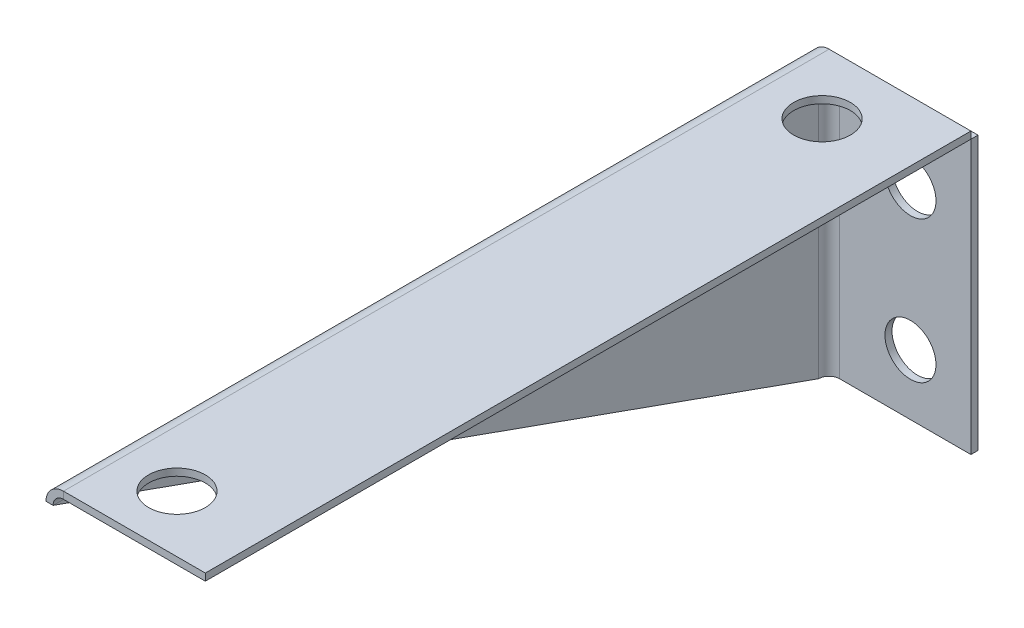
ISO-10303-21;
HEADER;
FILE_DESCRIPTION(('STEP AP214'),'2;1');
FILE_NAME('part.step','',(''),(''),'','','');
FILE_SCHEMA(('AUTOMOTIVE_DESIGN { 1 0 10303 214 1 1 1 1 }'));
ENDSEC;
DATA;
#1=APPLICATION_CONTEXT('core data for automotive mechanical design processes');
#2=APPLICATION_PROTOCOL_DEFINITION('international standard','automotive_design',2000,#1);
#3=PRODUCT_CONTEXT('',#1,'mechanical');
#4=PRODUCT('Part','Part','',(#3));
#5=PRODUCT_RELATED_PRODUCT_CATEGORY('part','',(#4));
#6=PRODUCT_DEFINITION_FORMATION('','',#4);
#7=PRODUCT_DEFINITION_CONTEXT('part definition',#1,'design');
#8=PRODUCT_DEFINITION('design','',#6,#7);
#9=PRODUCT_DEFINITION_SHAPE('','',#8);
#10=(LENGTH_UNIT() NAMED_UNIT(*) SI_UNIT(.MILLI.,.METRE.));
#11=(NAMED_UNIT(*) PLANE_ANGLE_UNIT() SI_UNIT($,.RADIAN.));
#12=(NAMED_UNIT(*) SI_UNIT($,.STERADIAN.) SOLID_ANGLE_UNIT());
#13=UNCERTAINTY_MEASURE_WITH_UNIT(LENGTH_MEASURE(1.E-05),#10,'distance_accuracy_value','');
#14=(GEOMETRIC_REPRESENTATION_CONTEXT(3) GLOBAL_UNCERTAINTY_ASSIGNED_CONTEXT((#13)) GLOBAL_UNIT_ASSIGNED_CONTEXT((#10,
#11,#12)) REPRESENTATION_CONTEXT('',''));
#15=CARTESIAN_POINT('',(0.,0.,0.));
#16=DIRECTION('',(0.,0.,1.));
#17=DIRECTION('',(1.,0.,0.));
#18=AXIS2_PLACEMENT_3D('',#15,#16,#17);
#19=CARTESIAN_POINT('',(-37.6927723239376,1.28228497629736E-13,0.));
#20=DIRECTION('',(-1.,0.,0.));
#21=DIRECTION('',(0.,-1.,0.));
#22=AXIS2_PLACEMENT_3D('',#19,#20,#21);
#23=PLANE('',#22);
#24=DIRECTION('',(0.,1.,0.));
#25=VECTOR('',#24,1.);
#26=CARTESIAN_POINT('',(-37.6927723239376,-0.499999999999998,-20.4635156034365));
#27=LINE('',#26,#25);
#28=CARTESIAN_POINT('',(-37.6927723239377,-20.5,-20.4635156034365));
#29=VERTEX_POINT('',#28);
#30=CARTESIAN_POINT('',(-37.6927723239377,-1.2366,-20.4635156034365));
#31=VERTEX_POINT('',#30);
#32=EDGE_CURVE('E212',#29,#31,#27,.T.);
#33=ORIENTED_EDGE('',*,*,#32,.F.);
#34=DIRECTION('',(0.,-0.335991197489804,-0.941865125805902));
#35=VECTOR('',#34,1.);
#36=CARTESIAN_POINT('',(-37.6927723239377,-11.7099020296282,4.17726901402858));
#37=LINE('',#36,#35);
#38=CARTESIAN_POINT('',(-37.6927723239376,-1.2366,33.5364843965635));
#39=VERTEX_POINT('',#38);
#40=EDGE_CURVE('E202',#39,#29,#37,.T.);
#41=ORIENTED_EDGE('',*,*,#40,.F.);
#42=DIRECTION('',(0.,0.,-1.));
#43=VECTOR('',#42,1.);
#44=CARTESIAN_POINT('',(-37.6927723239376,-1.2366,0.));
#45=LINE('',#44,#43);
#46=EDGE_CURVE('E218',#39,#31,#45,.T.);
#47=ORIENTED_EDGE('',*,*,#46,.T.);
#48=EDGE_LOOP('',(#33,#41,#47));
#49=FACE_BOUND('',#48,.T.);
#50=ADVANCED_FACE('F76',(#49),#23,.T.);
#51=CARTESIAN_POINT('',(-37.1927723239376,1.26482755949181E-13,0.));
#52=DIRECTION('',(-1.,0.,0.));
#53=DIRECTION('',(0.,-1.,0.));
#54=AXIS2_PLACEMENT_3D('',#51,#52,#53);
#55=PLANE('',#54);
#56=DIRECTION('',(0.,-0.335991197489804,-0.941865125805902));
#57=VECTOR('',#56,1.);
#58=CARTESIAN_POINT('',(-37.1927723239377,-11.7099020296282,4.17726901402858));
#59=LINE('',#58,#57);
#60=CARTESIAN_POINT('',(-37.1927723239376,-1.2366,33.5364843965635));
#61=VERTEX_POINT('',#60);
#62=CARTESIAN_POINT('',(-37.1927723239377,-20.5,-20.4635156034365));
#63=VERTEX_POINT('',#62);
#64=EDGE_CURVE('E193',#61,#63,#59,.T.);
#65=ORIENTED_EDGE('',*,*,#64,.T.);
#66=DIRECTION('',(0.,-1.,0.));
#67=VECTOR('',#66,1.);
#68=CARTESIAN_POINT('',(-37.1927723239376,1.30032610041011E-13,-20.4635156034365));
#69=LINE('',#68,#67);
#70=CARTESIAN_POINT('',(-37.1927723239376,-1.2366,-20.4635156034365));
#71=VERTEX_POINT('',#70);
#72=EDGE_CURVE('E215',#63,#71,#69,.F.);
#73=ORIENTED_EDGE('',*,*,#72,.T.);
#74=DIRECTION('',(0.,0.,1.));
#75=VECTOR('',#74,1.);
#76=CARTESIAN_POINT('',(-37.1927723239376,-1.2366,33.5364843965635));
#77=LINE('',#76,#75);
#78=EDGE_CURVE('E224',#61,#71,#77,.F.);
#79=ORIENTED_EDGE('',*,*,#78,.F.);
#80=EDGE_LOOP('',(#65,#73,#79));
#81=FACE_BOUND('',#80,.T.);
#82=ADVANCED_FACE('F323',(#81),#55,.F.);
#83=CARTESIAN_POINT('',(-36.4561723239376,-0.5,-20.4635156034365));
#84=DIRECTION('',(0.,0.,-1.));
#85=DIRECTION('',(-1.,0.,0.));
#86=AXIS2_PLACEMENT_3D('',#83,#84,#85);
#87=PLANE('',#86);
#88=DIRECTION('',(-1.,0.,0.));
#89=VECTOR('',#88,1.);
#90=CARTESIAN_POINT('',(-36.4561723239376,0.,-20.4635156034365));
#91=LINE('',#90,#89);
#92=CARTESIAN_POINT('',(-26.4561723239376,0.,-20.4635156034365));
#93=VERTEX_POINT('',#92);
#94=CARTESIAN_POINT('',(-36.4561723239376,0.,-20.4635156034365));
#95=VERTEX_POINT('',#94);
#96=EDGE_CURVE('E123',#93,#95,#91,.T.);
#97=ORIENTED_EDGE('',*,*,#96,.F.);
#98=DIRECTION('',(0.,1.,0.));
#99=VECTOR('',#98,1.);
#100=CARTESIAN_POINT('',(-26.4561723239376,-0.5,-20.4635156034365));
#101=LINE('',#100,#99);
#102=CARTESIAN_POINT('',(-26.4561723239376,-0.5,-20.4635156034365));
#103=VERTEX_POINT('',#102);
#104=EDGE_CURVE('E86',#103,#93,#101,.T.);
#105=ORIENTED_EDGE('',*,*,#104,.F.);
#106=DIRECTION('',(-1.,0.,0.));
#107=VECTOR('',#106,1.);
#108=CARTESIAN_POINT('',(-36.4561723239376,-0.5,-20.4635156034365));
#109=LINE('',#108,#107);
#110=CARTESIAN_POINT('',(-36.4561723239376,-0.500000000000003,-20.4635156034365));
#111=VERTEX_POINT('',#110);
#112=EDGE_CURVE('E138',#103,#111,#109,.T.);
#113=ORIENTED_EDGE('',*,*,#112,.T.);
#114=DIRECTION('',(0.,1.,0.));
#115=VECTOR('',#114,1.);
#116=CARTESIAN_POINT('',(-36.4561723239376,-0.5,-20.4635156034365));
#117=LINE('',#116,#115);
#118=EDGE_CURVE('E13',#111,#95,#117,.T.);
#119=ORIENTED_EDGE('',*,*,#118,.T.);
#120=EDGE_LOOP('',(#97,#105,#113,#119));
#121=FACE_BOUND('',#120,.T.);
#122=ADVANCED_FACE('F126',(#121),#87,.T.);
#123=CARTESIAN_POINT('',(-26.4561723239376,-0.5,-20.4635156034365));
#124=DIRECTION('',(1.,0.,0.));
#125=DIRECTION('',(0.,0.,-1.));
#126=AXIS2_PLACEMENT_3D('',#123,#124,#125);
#127=PLANE('',#126);
#128=DIRECTION('',(0.,0.,-1.));
#129=VECTOR('',#128,1.);
#130=CARTESIAN_POINT('',(-26.4561723239376,0.,-20.4635156034365));
#131=LINE('',#130,#129);
#132=CARTESIAN_POINT('',(-26.4561723239376,0.,33.5364843965635));
#133=VERTEX_POINT('',#132);
#134=EDGE_CURVE('E113',#133,#93,#131,.T.);
#135=ORIENTED_EDGE('',*,*,#134,.F.);
#136=DIRECTION('',(0.,1.,0.));
#137=VECTOR('',#136,1.);
#138=CARTESIAN_POINT('',(-26.4561723239376,-0.5,33.5364843965635));
#139=LINE('',#138,#137);
#140=CARTESIAN_POINT('',(-26.4561723239376,-0.5,33.5364843965635));
#141=VERTEX_POINT('',#140);
#142=EDGE_CURVE('E108',#141,#133,#139,.T.);
#143=ORIENTED_EDGE('',*,*,#142,.F.);
#144=DIRECTION('',(0.,0.,-1.));
#145=VECTOR('',#144,1.);
#146=CARTESIAN_POINT('',(-26.4561723239376,-0.5,-20.4635156034365));
#147=LINE('',#146,#145);
#148=EDGE_CURVE('E116',#141,#103,#147,.T.);
#149=ORIENTED_EDGE('',*,*,#148,.T.);
#150=ORIENTED_EDGE('',*,*,#104,.T.);
#151=EDGE_LOOP('',(#135,#143,#149,#150));
#152=FACE_BOUND('',#151,.T.);
#153=ADVANCED_FACE('F112',(#152),#127,.T.);
#154=CARTESIAN_POINT('',(-36.4561723239376,-0.5,33.5364843965635));
#155=DIRECTION('',(0.,0.,1.));
#156=DIRECTION('',(1.,0.,0.));
#157=AXIS2_PLACEMENT_3D('',#154,#155,#156);
#158=PLANE('',#157);
#159=DIRECTION('',(1.,0.,0.));
#160=VECTOR('',#159,1.);
#161=CARTESIAN_POINT('',(-36.4561723239376,0.,33.5364843965635));
#162=LINE('',#161,#160);
#163=CARTESIAN_POINT('',(-36.4561723239376,0.,33.5364843965635));
#164=VERTEX_POINT('',#163);
#165=EDGE_CURVE('E124',#164,#133,#162,.T.);
#166=ORIENTED_EDGE('',*,*,#165,.F.);
#167=DIRECTION('',(0.,1.,0.));
#168=VECTOR('',#167,1.);
#169=CARTESIAN_POINT('',(-36.4561723239376,-0.5,33.5364843965635));
#170=LINE('',#169,#168);
#171=CARTESIAN_POINT('',(-36.4561723239376,-0.500000000000003,33.5364843965635));
#172=VERTEX_POINT('',#171);
#173=EDGE_CURVE('E136',#172,#164,#170,.T.);
#174=ORIENTED_EDGE('',*,*,#173,.F.);
#175=DIRECTION('',(1.,0.,0.));
#176=VECTOR('',#175,1.);
#177=CARTESIAN_POINT('',(-36.4561723239376,-0.5,33.5364843965635));
#178=LINE('',#177,#176);
#179=EDGE_CURVE('E131',#172,#141,#178,.T.);
#180=ORIENTED_EDGE('',*,*,#179,.T.);
#181=ORIENTED_EDGE('',*,*,#142,.T.);
#182=EDGE_LOOP('',(#166,#174,#180,#181));
#183=FACE_BOUND('',#182,.T.);
#184=ADVANCED_FACE('F78',(#183),#158,.T.);
#185=CARTESIAN_POINT('',(0.,-0.5,0.));
#186=DIRECTION('',(0.,1.,0.));
#187=DIRECTION('',(0.,0.,1.));
#188=AXIS2_PLACEMENT_3D('',#185,#186,#187);
#189=PLANE('',#188);
#190=CARTESIAN_POINT('',(-32.4561723239376,-0.5,-15.9635156034365));
#191=DIRECTION('',(0.,1.,0.));
#192=DIRECTION('',(0.,0.,1.));
#193=AXIS2_PLACEMENT_3D('',#190,#191,#192);
#194=CIRCLE('',#193,2.);
#195=CARTESIAN_POINT('',(-32.4561723239376,-0.5,-13.9635156034365));
#196=VERTEX_POINT('',#195);
#197=EDGE_CURVE('E606',#196,#196,#194,.T.);
#198=ORIENTED_EDGE('',*,*,#197,.T.);
#199=EDGE_LOOP('',(#198));
#200=FACE_BOUND('',#199,.T.);
#201=CARTESIAN_POINT('',(-32.4561723239376,-0.5,29.5364843965635));
#202=DIRECTION('',(0.,1.,0.));
#203=DIRECTION('',(0.,0.,1.));
#204=AXIS2_PLACEMENT_3D('',#201,#202,#203);
#205=CIRCLE('',#204,2.);
#206=CARTESIAN_POINT('',(-32.4561723239376,-0.5,31.5364843965635));
#207=VERTEX_POINT('',#206);
#208=EDGE_CURVE('E610',#207,#207,#205,.T.);
#209=ORIENTED_EDGE('',*,*,#208,.T.);
#210=EDGE_LOOP('',(#209));
#211=FACE_BOUND('',#210,.T.);
#212=DIRECTION('',(0.,0.,1.));
#213=VECTOR('',#212,1.);
#214=CARTESIAN_POINT('',(-36.4561723239376,-0.5,-20.4635156034365));
#215=LINE('',#214,#213);
#216=EDGE_CURVE('E128',#111,#172,#215,.T.);
#217=ORIENTED_EDGE('',*,*,#216,.F.);
#218=ORIENTED_EDGE('',*,*,#112,.F.);
#219=ORIENTED_EDGE('',*,*,#148,.F.);
#220=ORIENTED_EDGE('',*,*,#179,.F.);
#221=EDGE_LOOP('',(#217,#218,#219,#220));
#222=FACE_BOUND('',#221,.T.);
#223=ADVANCED_FACE('F335',(#200,#211,#222),#189,.F.);
#224=CARTESIAN_POINT('',(0.,0.,0.));
#225=DIRECTION('',(0.,1.,0.));
#226=DIRECTION('',(0.,0.,1.));
#227=AXIS2_PLACEMENT_3D('',#224,#225,#226);
#228=PLANE('',#227);
#229=CARTESIAN_POINT('',(-32.4561723239376,0.,-15.9635156034365));
#230=DIRECTION('',(0.,1.,0.));
#231=DIRECTION('',(0.,0.,1.));
#232=AXIS2_PLACEMENT_3D('',#229,#230,#231);
#233=CIRCLE('',#232,2.);
#234=CARTESIAN_POINT('',(-32.4561723239376,0.,-13.9635156034365));
#235=VERTEX_POINT('',#234);
#236=EDGE_CURVE('E603',#235,#235,#233,.T.);
#237=ORIENTED_EDGE('',*,*,#236,.F.);
#238=EDGE_LOOP('',(#237));
#239=FACE_BOUND('',#238,.T.);
#240=CARTESIAN_POINT('',(-32.4561723239376,0.,29.5364843965635));
#241=DIRECTION('',(0.,1.,0.));
#242=DIRECTION('',(0.,0.,1.));
#243=AXIS2_PLACEMENT_3D('',#240,#241,#242);
#244=CIRCLE('',#243,2.);
#245=CARTESIAN_POINT('',(-32.4561723239376,0.,31.5364843965635));
#246=VERTEX_POINT('',#245);
#247=EDGE_CURVE('E607',#246,#246,#244,.T.);
#248=ORIENTED_EDGE('',*,*,#247,.F.);
#249=EDGE_LOOP('',(#248));
#250=FACE_BOUND('',#249,.T.);
#251=DIRECTION('',(0.,0.,1.));
#252=VECTOR('',#251,1.);
#253=CARTESIAN_POINT('',(-36.4561723239376,0.,-20.4635156034365));
#254=LINE('',#253,#252);
#255=EDGE_CURVE('E232',#95,#164,#254,.T.);
#256=ORIENTED_EDGE('',*,*,#255,.T.);
#257=ORIENTED_EDGE('',*,*,#165,.T.);
#258=ORIENTED_EDGE('',*,*,#134,.T.);
#259=ORIENTED_EDGE('',*,*,#96,.T.);
#260=EDGE_LOOP('',(#256,#257,#258,#259));
#261=FACE_BOUND('',#260,.T.);
#262=ADVANCED_FACE('F122',(#239,#250,#261),#228,.T.);
#263=CARTESIAN_POINT('',(-36.4561723239376,-1.2366,33.5364843965635));
#264=DIRECTION('',(0.,0.,1.));
#265=DIRECTION('',(1.,0.,0.));
#266=AXIS2_PLACEMENT_3D('',#263,#264,#265);
#267=PLANE('',#266);
#268=DIRECTION('',(-1.,0.,0.));
#269=VECTOR('',#268,1.);
#270=CARTESIAN_POINT('',(-37.6927723239376,-1.23659999999999,33.5364843965635));
#271=LINE('',#270,#269);
#272=EDGE_CURVE('E205',#61,#39,#271,.T.);
#273=ORIENTED_EDGE('',*,*,#272,.F.);
#274=CARTESIAN_POINT('',(-36.4561723239376,-1.2366,33.5364843965635));
#275=DIRECTION('',(0.,0.,-1.));
#276=DIRECTION('',(-1.,0.,0.));
#277=AXIS2_PLACEMENT_3D('',#274,#275,#276);
#278=CIRCLE('',#277,0.736599999999997);
#279=EDGE_CURVE('E236',#172,#61,#278,.F.);
#280=ORIENTED_EDGE('',*,*,#279,.F.);
#281=ORIENTED_EDGE('',*,*,#173,.T.);
#282=CARTESIAN_POINT('',(-36.4561723239376,-1.2366,33.5364843965635));
#283=DIRECTION('',(0.,0.,-1.));
#284=DIRECTION('',(-1.,0.,0.));
#285=AXIS2_PLACEMENT_3D('',#282,#283,#284);
#286=CIRCLE('',#285,1.2366);
#287=EDGE_CURVE('E229',#164,#39,#286,.F.);
#288=ORIENTED_EDGE('',*,*,#287,.T.);
#289=EDGE_LOOP('',(#273,#280,#281,#288));
#290=FACE_BOUND('',#289,.T.);
#291=ADVANCED_FACE('F331',(#290),#267,.T.);
#292=CARTESIAN_POINT('',(-36.4561723239376,-1.2366,-20.4635156034365));
#293=DIRECTION('',(0.,0.,1.));
#294=DIRECTION('',(1.,0.,0.));
#295=AXIS2_PLACEMENT_3D('',#292,#293,#294);
#296=PLANE('',#295);
#297=CARTESIAN_POINT('',(-36.4561723239376,-1.2366,-20.4635156034365));
#298=DIRECTION('',(0.,0.,-1.));
#299=DIRECTION('',(-1.,0.,0.));
#300=AXIS2_PLACEMENT_3D('',#297,#298,#299);
#301=CIRCLE('',#300,0.736599999999997);
#302=EDGE_CURVE('E211',#71,#111,#301,.T.);
#303=ORIENTED_EDGE('',*,*,#302,.F.);
#304=DIRECTION('',(-1.,0.,0.));
#305=VECTOR('',#304,1.);
#306=CARTESIAN_POINT('',(-37.1927723239376,-1.2366,-20.4635156034365));
#307=LINE('',#306,#305);
#308=EDGE_CURVE('E221',#71,#31,#307,.T.);
#309=ORIENTED_EDGE('',*,*,#308,.T.);
#310=CARTESIAN_POINT('',(-36.4561723239376,-1.2366,-20.4635156034365));
#311=DIRECTION('',(0.,0.,-1.));
#312=DIRECTION('',(-1.,0.,0.));
#313=AXIS2_PLACEMENT_3D('',#310,#311,#312);
#314=CIRCLE('',#313,1.2366);
#315=EDGE_CURVE('E233',#31,#95,#314,.T.);
#316=ORIENTED_EDGE('',*,*,#315,.T.);
#317=ORIENTED_EDGE('',*,*,#118,.F.);
#318=EDGE_LOOP('',(#303,#309,#316,#317));
#319=FACE_BOUND('',#318,.T.);
#320=ADVANCED_FACE('F254',(#319),#296,.F.);
#321=CARTESIAN_POINT('',(-36.4561723239376,-1.2366,-20.4635156034365));
#322=DIRECTION('',(0.,0.,-1.));
#323=DIRECTION('',(-1.,0.,0.));
#324=AXIS2_PLACEMENT_3D('',#321,#322,#323);
#325=CYLINDRICAL_SURFACE('',#324,1.2366);
#326=ORIENTED_EDGE('',*,*,#255,.F.);
#327=ORIENTED_EDGE('',*,*,#315,.F.);
#328=ORIENTED_EDGE('',*,*,#46,.F.);
#329=ORIENTED_EDGE('',*,*,#287,.F.);
#330=EDGE_LOOP('',(#326,#327,#328,#329));
#331=FACE_BOUND('',#330,.T.);
#332=ADVANCED_FACE('F247',(#331),#325,.T.);
#333=CARTESIAN_POINT('',(-36.4561723239376,-1.2366,-20.4635156034365));
#334=DIRECTION('',(0.,0.,-1.));
#335=DIRECTION('',(-1.,0.,0.));
#336=AXIS2_PLACEMENT_3D('',#333,#334,#335);
#337=CYLINDRICAL_SURFACE('',#336,0.736599999999997);
#338=ORIENTED_EDGE('',*,*,#216,.T.);
#339=ORIENTED_EDGE('',*,*,#279,.T.);
#340=ORIENTED_EDGE('',*,*,#78,.T.);
#341=ORIENTED_EDGE('',*,*,#302,.T.);
#342=EDGE_LOOP('',(#338,#339,#340,#341));
#343=FACE_BOUND('',#342,.T.);
#344=ADVANCED_FACE('F326',(#343),#337,.F.);
#345=CARTESIAN_POINT('',(-37.1927723239377,-11.7099020296282,4.17726901402858));
#346=DIRECTION('',(0.,0.941865125805902,-0.335991197489804));
#347=DIRECTION('',(0.,-0.335991197489804,-0.941865125805902));
#348=AXIS2_PLACEMENT_3D('',#345,#346,#347);
#349=PLANE('',#348);
#350=DIRECTION('',(1.,0.,0.));
#351=VECTOR('',#350,1.);
#352=CARTESIAN_POINT('',(-37.6927723239377,-20.5,-20.4635156034365));
#353=LINE('',#352,#351);
#354=EDGE_CURVE('E208',#29,#63,#353,.T.);
#355=ORIENTED_EDGE('',*,*,#354,.T.);
#356=ORIENTED_EDGE('',*,*,#64,.F.);
#357=ORIENTED_EDGE('',*,*,#272,.T.);
#358=ORIENTED_EDGE('',*,*,#40,.T.);
#359=EDGE_LOOP('',(#355,#356,#357,#358));
#360=FACE_BOUND('',#359,.T.);
#361=ADVANCED_FACE('F316',(#360),#349,.F.);
#362=CARTESIAN_POINT('',(-36.4561723239377,-20.5,-20.4635156034365));
#363=DIRECTION('',(0.,-1.,0.));
#364=DIRECTION('',(0.,0.,-1.));
#365=AXIS2_PLACEMENT_3D('',#362,#363,#364);
#366=PLANE('',#365);
#367=DIRECTION('',(0.,0.,-1.));
#368=VECTOR('',#367,1.);
#369=CARTESIAN_POINT('',(-36.4561723239377,-20.5,-21.7001156034365));
#370=LINE('',#369,#368);
#371=CARTESIAN_POINT('',(-36.4561723239377,-20.5,-21.2001156034365));
#372=VERTEX_POINT('',#371);
#373=CARTESIAN_POINT('',(-36.4561723239377,-20.5,-21.7001156034365));
#374=VERTEX_POINT('',#373);
#375=EDGE_CURVE('E141',#372,#374,#370,.T.);
#376=ORIENTED_EDGE('',*,*,#375,.F.);
#377=CARTESIAN_POINT('',(-36.4561723239377,-20.5,-20.4635156034365));
#378=DIRECTION('',(0.,1.,0.));
#379=DIRECTION('',(0.,0.,1.));
#380=AXIS2_PLACEMENT_3D('',#377,#378,#379);
#381=CIRCLE('',#380,0.736600000000004);
#382=EDGE_CURVE('E197',#63,#372,#381,.F.);
#383=ORIENTED_EDGE('',*,*,#382,.F.);
#384=ORIENTED_EDGE('',*,*,#354,.F.);
#385=CARTESIAN_POINT('',(-36.4561723239377,-20.5,-20.4635156034365));
#386=DIRECTION('',(0.,1.,0.));
#387=DIRECTION('',(0.,0.,1.));
#388=AXIS2_PLACEMENT_3D('',#385,#386,#387);
#389=CIRCLE('',#388,1.2366);
#390=EDGE_CURVE('E190',#29,#374,#389,.F.);
#391=ORIENTED_EDGE('',*,*,#390,.T.);
#392=EDGE_LOOP('',(#376,#383,#384,#391));
#393=FACE_BOUND('',#392,.T.);
#394=ADVANCED_FACE('F311',(#393),#366,.T.);
#395=CARTESIAN_POINT('',(-36.4561723239377,-1.2366,-20.4635156034365));
#396=DIRECTION('',(0.,-1.,0.));
#397=DIRECTION('',(0.,0.,-1.));
#398=AXIS2_PLACEMENT_3D('',#395,#396,#397);
#399=PLANE('',#398);
#400=CARTESIAN_POINT('',(-36.4561723239377,-1.2366,-20.4635156034365));
#401=DIRECTION('',(0.,1.,0.));
#402=DIRECTION('',(0.,0.,1.));
#403=AXIS2_PLACEMENT_3D('',#400,#401,#402);
#404=CIRCLE('',#403,0.736600000000004);
#405=CARTESIAN_POINT('',(-36.4561723239377,-1.2366,-21.2001156034365));
#406=VERTEX_POINT('',#405);
#407=EDGE_CURVE('E160',#406,#71,#404,.T.);
#408=ORIENTED_EDGE('',*,*,#407,.F.);
#409=DIRECTION('',(0.,0.,-1.));
#410=VECTOR('',#409,1.);
#411=CARTESIAN_POINT('',(-36.4561723239376,-1.2366,-21.2001156034365));
#412=LINE('',#411,#410);
#413=CARTESIAN_POINT('',(-36.4561723239376,-1.2366,-21.7001156034365));
#414=VERTEX_POINT('',#413);
#415=EDGE_CURVE('E185',#406,#414,#412,.T.);
#416=ORIENTED_EDGE('',*,*,#415,.T.);
#417=CARTESIAN_POINT('',(-36.4561723239377,-1.2366,-20.4635156034365));
#418=DIRECTION('',(0.,1.,0.));
#419=DIRECTION('',(0.,0.,1.));
#420=AXIS2_PLACEMENT_3D('',#417,#418,#419);
#421=CIRCLE('',#420,1.2366);
#422=EDGE_CURVE('E194',#414,#31,#421,.T.);
#423=ORIENTED_EDGE('',*,*,#422,.T.);
#424=ORIENTED_EDGE('',*,*,#308,.F.);
#425=EDGE_LOOP('',(#408,#416,#423,#424));
#426=FACE_BOUND('',#425,.T.);
#427=ADVANCED_FACE('F263',(#426),#399,.F.);
#428=CARTESIAN_POINT('',(-36.4561723239377,-1.2366,-20.4635156034365));
#429=DIRECTION('',(0.,1.,0.));
#430=DIRECTION('',(0.,0.,-1.));
#431=AXIS2_PLACEMENT_3D('',#428,#429,#430);
#432=CYLINDRICAL_SURFACE('',#431,1.2366);
#433=ORIENTED_EDGE('',*,*,#32,.T.);
#434=ORIENTED_EDGE('',*,*,#422,.F.);
#435=DIRECTION('',(0.,1.,0.));
#436=VECTOR('',#435,1.);
#437=CARTESIAN_POINT('',(-36.4561723239376,1.48359481234848E-13,-21.7001156034365));
#438=LINE('',#437,#436);
#439=EDGE_CURVE('E182',#374,#414,#438,.T.);
#440=ORIENTED_EDGE('',*,*,#439,.F.);
#441=ORIENTED_EDGE('',*,*,#390,.F.);
#442=EDGE_LOOP('',(#433,#434,#440,#441));
#443=FACE_BOUND('',#442,.T.);
#444=ADVANCED_FACE('F307',(#443),#432,.T.);
#445=CARTESIAN_POINT('',(-36.4561723239377,-1.2366,-20.4635156034365));
#446=DIRECTION('',(0.,1.,0.));
#447=DIRECTION('',(0.,0.,-1.));
#448=AXIS2_PLACEMENT_3D('',#445,#446,#447);
#449=CYLINDRICAL_SURFACE('',#448,0.736600000000004);
#450=ORIENTED_EDGE('',*,*,#72,.F.);
#451=ORIENTED_EDGE('',*,*,#382,.T.);
#452=DIRECTION('',(0.,-1.,0.));
#453=VECTOR('',#452,1.);
#454=CARTESIAN_POINT('',(-36.4561723239377,-20.5,-21.2001156034365));
#455=LINE('',#454,#453);
#456=EDGE_CURVE('E146',#372,#406,#455,.F.);
#457=ORIENTED_EDGE('',*,*,#456,.T.);
#458=ORIENTED_EDGE('',*,*,#407,.T.);
#459=EDGE_LOOP('',(#450,#451,#457,#458));
#460=FACE_BOUND('',#459,.T.);
#461=ADVANCED_FACE('F269',(#460),#449,.F.);
#462=CARTESIAN_POINT('',(-37.1927723239376,-1.2366,-21.7001156034365));
#463=DIRECTION('',(0.,1.,0.));
#464=DIRECTION('',(-1.,0.,0.));
#465=AXIS2_PLACEMENT_3D('',#462,#463,#464);
#466=PLANE('',#465);
#467=DIRECTION('',(-1.,0.,0.));
#468=VECTOR('',#467,1.);
#469=CARTESIAN_POINT('',(-37.1927723239376,-1.2366,-21.7001156034365));
#470=LINE('',#469,#468);
#471=CARTESIAN_POINT('',(-27.1927723239376,-1.23660000000001,-21.7001156034365));
#472=VERTEX_POINT('',#471);
#473=EDGE_CURVE('E164',#472,#414,#470,.T.);
#474=ORIENTED_EDGE('',*,*,#473,.T.);
#475=ORIENTED_EDGE('',*,*,#415,.F.);
#476=DIRECTION('',(1.,0.,0.));
#477=VECTOR('',#476,1.);
#478=CARTESIAN_POINT('',(0.,-1.23660000000005,-21.2001156034366));
#479=LINE('',#478,#477);
#480=CARTESIAN_POINT('',(-27.1927723239376,-1.23660000000001,-21.2001156034365));
#481=VERTEX_POINT('',#480);
#482=EDGE_CURVE('E173',#481,#406,#479,.F.);
#483=ORIENTED_EDGE('',*,*,#482,.F.);
#484=DIRECTION('',(0.,0.,1.));
#485=VECTOR('',#484,1.);
#486=CARTESIAN_POINT('',(-27.1927723239376,-1.23660000000001,-21.7001156034365));
#487=LINE('',#486,#485);
#488=EDGE_CURVE('E157',#472,#481,#487,.T.);
#489=ORIENTED_EDGE('',*,*,#488,.F.);
#490=EDGE_LOOP('',(#474,#475,#483,#489));
#491=FACE_BOUND('',#490,.T.);
#492=ADVANCED_FACE('F298',(#491),#466,.T.);
#493=CARTESIAN_POINT('',(-27.1927723239377,-20.5,-21.7001156034365));
#494=DIRECTION('',(0.,-1.,0.));
#495=DIRECTION('',(1.,0.,0.));
#496=AXIS2_PLACEMENT_3D('',#493,#494,#495);
#497=PLANE('',#496);
#498=DIRECTION('',(-1.,0.,0.));
#499=VECTOR('',#498,1.);
#500=CARTESIAN_POINT('',(-1.06735558331819E-13,-20.5,-21.2001156034366));
#501=LINE('',#500,#499);
#502=CARTESIAN_POINT('',(-27.1927723239377,-20.5,-21.2001156034365));
#503=VERTEX_POINT('',#502);
#504=EDGE_CURVE('E179',#372,#503,#501,.F.);
#505=ORIENTED_EDGE('',*,*,#504,.F.);
#506=ORIENTED_EDGE('',*,*,#375,.T.);
#507=DIRECTION('',(1.,0.,0.));
#508=VECTOR('',#507,1.);
#509=CARTESIAN_POINT('',(-27.1927723239377,-20.5,-21.7001156034365));
#510=LINE('',#509,#508);
#511=CARTESIAN_POINT('',(-27.1927723239377,-20.5,-21.7001156034365));
#512=VERTEX_POINT('',#511);
#513=EDGE_CURVE('E170',#374,#512,#510,.T.);
#514=ORIENTED_EDGE('',*,*,#513,.T.);
#515=DIRECTION('',(0.,0.,1.));
#516=VECTOR('',#515,1.);
#517=CARTESIAN_POINT('',(-27.1927723239377,-20.5,-21.7001156034365));
#518=LINE('',#517,#516);
#519=EDGE_CURVE('E161',#512,#503,#518,.T.);
#520=ORIENTED_EDGE('',*,*,#519,.T.);
#521=EDGE_LOOP('',(#505,#506,#514,#520));
#522=FACE_BOUND('',#521,.T.);
#523=ADVANCED_FACE('F285',(#522),#497,.T.);
#524=CARTESIAN_POINT('',(0.,0.,-21.7001156034366));
#525=DIRECTION('',(0.,0.,-1.));
#526=DIRECTION('',(-1.,0.,0.));
#527=AXIS2_PLACEMENT_3D('',#524,#525,#526);
#528=PLANE('',#527);
#529=CARTESIAN_POINT('',(-31.4561723239377,-16.2366,-21.7001156034365));
#530=DIRECTION('',(0.,0.,-1.));
#531=DIRECTION('',(-1.,0.,0.));
#532=AXIS2_PLACEMENT_3D('',#529,#530,#531);
#533=CIRCLE('',#532,1.8);
#534=CARTESIAN_POINT('',(-33.2561723239377,-16.2366,-21.7001156034365));
#535=VERTEX_POINT('',#534);
#536=EDGE_CURVE('E153',#535,#535,#533,.T.);
#537=ORIENTED_EDGE('',*,*,#536,.F.);
#538=EDGE_LOOP('',(#537));
#539=FACE_BOUND('',#538,.T.);
#540=CARTESIAN_POINT('',(-31.4561723239377,-6.23660000000001,-21.7001156034365));
#541=DIRECTION('',(0.,0.,-1.));
#542=DIRECTION('',(-1.,0.,0.));
#543=AXIS2_PLACEMENT_3D('',#540,#541,#542);
#544=CIRCLE('',#543,1.8);
#545=CARTESIAN_POINT('',(-33.2561723239377,-6.23660000000001,-21.7001156034365));
#546=VERTEX_POINT('',#545);
#547=EDGE_CURVE('E142',#546,#546,#544,.T.);
#548=ORIENTED_EDGE('',*,*,#547,.F.);
#549=EDGE_LOOP('',(#548));
#550=FACE_BOUND('',#549,.T.);
#551=ORIENTED_EDGE('',*,*,#513,.F.);
#552=ORIENTED_EDGE('',*,*,#439,.T.);
#553=ORIENTED_EDGE('',*,*,#473,.F.);
#554=DIRECTION('',(0.,1.,0.));
#555=VECTOR('',#554,1.);
#556=CARTESIAN_POINT('',(-27.1927723239376,-1.23660000000001,-21.7001156034365));
#557=LINE('',#556,#555);
#558=EDGE_CURVE('E167',#512,#472,#557,.T.);
#559=ORIENTED_EDGE('',*,*,#558,.F.);
#560=EDGE_LOOP('',(#551,#552,#553,#559));
#561=FACE_BOUND('',#560,.T.);
#562=ADVANCED_FACE('F304',(#539,#550,#561),#528,.T.);
#563=CARTESIAN_POINT('',(0.,0.,-21.2001156034366));
#564=DIRECTION('',(0.,0.,-1.));
#565=DIRECTION('',(-1.,0.,0.));
#566=AXIS2_PLACEMENT_3D('',#563,#564,#565);
#567=PLANE('',#566);
#568=CARTESIAN_POINT('',(-31.4561723239377,-16.2366,-21.2001156034365));
#569=DIRECTION('',(0.,0.,-1.));
#570=DIRECTION('',(-1.,0.,0.));
#571=AXIS2_PLACEMENT_3D('',#568,#569,#570);
#572=CIRCLE('',#571,1.8);
#573=CARTESIAN_POINT('',(-33.2561723239377,-16.2366,-21.2001156034365));
#574=VERTEX_POINT('',#573);
#575=EDGE_CURVE('E80',#574,#574,#572,.T.);
#576=ORIENTED_EDGE('',*,*,#575,.T.);
#577=EDGE_LOOP('',(#576));
#578=FACE_BOUND('',#577,.T.);
#579=CARTESIAN_POINT('',(-31.4561723239377,-6.23660000000001,-21.2001156034365));
#580=DIRECTION('',(0.,0.,-1.));
#581=DIRECTION('',(-1.,0.,0.));
#582=AXIS2_PLACEMENT_3D('',#579,#580,#581);
#583=CIRCLE('',#582,1.8);
#584=CARTESIAN_POINT('',(-33.2561723239377,-6.23660000000001,-21.2001156034365));
#585=VERTEX_POINT('',#584);
#586=EDGE_CURVE('E139',#585,#585,#583,.T.);
#587=ORIENTED_EDGE('',*,*,#586,.T.);
#588=EDGE_LOOP('',(#587));
#589=FACE_BOUND('',#588,.T.);
#590=ORIENTED_EDGE('',*,*,#456,.F.);
#591=ORIENTED_EDGE('',*,*,#504,.T.);
#592=DIRECTION('',(0.,-1.,0.));
#593=VECTOR('',#592,1.);
#594=CARTESIAN_POINT('',(-27.1927723239376,1.11564835888752E-13,-21.2001156034365));
#595=LINE('',#594,#593);
#596=EDGE_CURVE('E176',#503,#481,#595,.F.);
#597=ORIENTED_EDGE('',*,*,#596,.T.);
#598=ORIENTED_EDGE('',*,*,#482,.T.);
#599=EDGE_LOOP('',(#590,#591,#597,#598));
#600=FACE_BOUND('',#599,.T.);
#601=ADVANCED_FACE('F277',(#578,#589,#600),#567,.F.);
#602=CARTESIAN_POINT('',(-27.1927723239376,-1.23660000000001,-21.7001156034365));
#603=DIRECTION('',(1.,0.,0.));
#604=DIRECTION('',(0.,1.,0.));
#605=AXIS2_PLACEMENT_3D('',#602,#603,#604);
#606=PLANE('',#605);
#607=ORIENTED_EDGE('',*,*,#596,.F.);
#608=ORIENTED_EDGE('',*,*,#519,.F.);
#609=ORIENTED_EDGE('',*,*,#558,.T.);
#610=ORIENTED_EDGE('',*,*,#488,.T.);
#611=EDGE_LOOP('',(#607,#608,#609,#610));
#612=FACE_BOUND('',#611,.T.);
#613=ADVANCED_FACE('F294',(#612),#606,.T.);
#614=CARTESIAN_POINT('',(-31.4561723239376,-6.23660000000001,-11.7001156034365));
#615=DIRECTION('',(0.,0.,-1.));
#616=DIRECTION('',(-1.,0.,0.));
#617=AXIS2_PLACEMENT_3D('',#614,#615,#616);
#618=CYLINDRICAL_SURFACE('',#617,1.8);
#619=ORIENTED_EDGE('',*,*,#547,.T.);
#620=EDGE_LOOP('',(#619));
#621=FACE_BOUND('',#620,.T.);
#622=ORIENTED_EDGE('',*,*,#586,.F.);
#623=EDGE_LOOP('',(#622));
#624=FACE_BOUND('',#623,.T.);
#625=ADVANCED_FACE('F460',(#621,#624),#618,.F.);
#626=CARTESIAN_POINT('',(-31.4561723239376,-16.2366,-11.7001156034365));
#627=DIRECTION('',(0.,0.,-1.));
#628=DIRECTION('',(-1.,0.,0.));
#629=AXIS2_PLACEMENT_3D('',#626,#627,#628);
#630=CYLINDRICAL_SURFACE('',#629,1.8);
#631=ORIENTED_EDGE('',*,*,#536,.T.);
#632=EDGE_LOOP('',(#631));
#633=FACE_BOUND('',#632,.T.);
#634=ORIENTED_EDGE('',*,*,#575,.F.);
#635=EDGE_LOOP('',(#634));
#636=FACE_BOUND('',#635,.T.);
#637=ADVANCED_FACE('F466',(#633,#636),#630,.F.);
#638=CARTESIAN_POINT('',(-32.4561723239376,-10.,29.5364843965635));
#639=DIRECTION('',(0.,1.,0.));
#640=DIRECTION('',(0.,0.,1.));
#641=AXIS2_PLACEMENT_3D('',#638,#639,#640);
#642=CYLINDRICAL_SURFACE('',#641,2.);
#643=ORIENTED_EDGE('',*,*,#247,.T.);
#644=EDGE_LOOP('',(#643));
#645=FACE_BOUND('',#644,.T.);
#646=ORIENTED_EDGE('',*,*,#208,.F.);
#647=EDGE_LOOP('',(#646));
#648=FACE_BOUND('',#647,.T.);
#649=ADVANCED_FACE('F472',(#645,#648),#642,.F.);
#650=CARTESIAN_POINT('',(-32.4561723239376,-10.,-15.9635156034365));
#651=DIRECTION('',(0.,1.,0.));
#652=DIRECTION('',(0.,0.,1.));
#653=AXIS2_PLACEMENT_3D('',#650,#651,#652);
#654=CYLINDRICAL_SURFACE('',#653,2.);
#655=ORIENTED_EDGE('',*,*,#236,.T.);
#656=EDGE_LOOP('',(#655));
#657=FACE_BOUND('',#656,.T.);
#658=ORIENTED_EDGE('',*,*,#197,.F.);
#659=EDGE_LOOP('',(#658));
#660=FACE_BOUND('',#659,.T.);
#661=ADVANCED_FACE('F479',(#657,#660),#654,.F.);
#662=CLOSED_SHELL('',(#50,#82,#122,#153,#184,#223,#262,#291,#320,#332,#344,#361,#394,#427,#444,
#461,#492,#523,#562,#601,#613,#625,#637,#649,#661));
#663=MANIFOLD_SOLID_BREP('B2',#662);
#664=ADVANCED_BREP_SHAPE_REPRESENTATION('',(#18,#663),#14);
#665=SHAPE_DEFINITION_REPRESENTATION(#9,#664);
ENDSEC;
END-ISO-10303-21;
